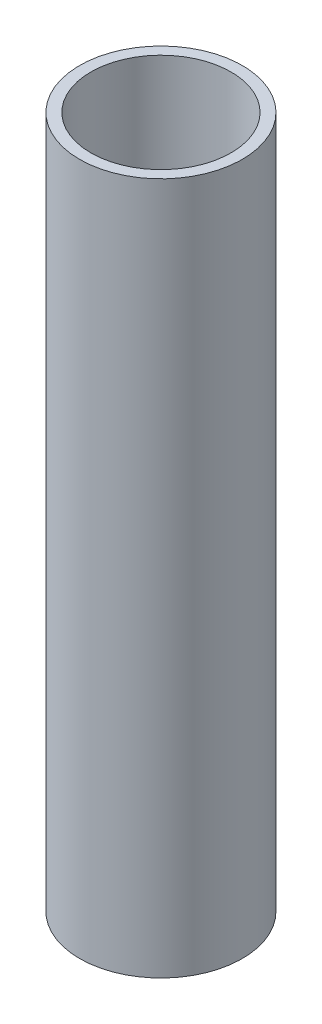
ISO-10303-21;
HEADER;
FILE_DESCRIPTION(('STEP AP214'),'2;1');
FILE_NAME('part.step','',(''),(''),'','','');
FILE_SCHEMA(('AUTOMOTIVE_DESIGN { 1 0 10303 214 1 1 1 1 }'));
ENDSEC;
DATA;
#1=APPLICATION_CONTEXT('core data for automotive mechanical design processes');
#2=APPLICATION_PROTOCOL_DEFINITION('international standard','automotive_design',2000,#1);
#3=PRODUCT_CONTEXT('',#1,'mechanical');
#4=PRODUCT('Part','Part','',(#3));
#5=PRODUCT_RELATED_PRODUCT_CATEGORY('part','',(#4));
#6=PRODUCT_DEFINITION_FORMATION('','',#4);
#7=PRODUCT_DEFINITION_CONTEXT('part definition',#1,'design');
#8=PRODUCT_DEFINITION('design','',#6,#7);
#9=PRODUCT_DEFINITION_SHAPE('','',#8);
#10=(LENGTH_UNIT() NAMED_UNIT(*) SI_UNIT(.MILLI.,.METRE.));
#11=(NAMED_UNIT(*) PLANE_ANGLE_UNIT() SI_UNIT($,.RADIAN.));
#12=(NAMED_UNIT(*) SI_UNIT($,.STERADIAN.) SOLID_ANGLE_UNIT());
#13=UNCERTAINTY_MEASURE_WITH_UNIT(LENGTH_MEASURE(1.E-05),#10,'distance_accuracy_value','');
#14=(GEOMETRIC_REPRESENTATION_CONTEXT(3) GLOBAL_UNCERTAINTY_ASSIGNED_CONTEXT((#13)) GLOBAL_UNIT_ASSIGNED_CONTEXT((#10,
#11,#12)) REPRESENTATION_CONTEXT('',''));
#15=CARTESIAN_POINT('',(0.,0.,0.));
#16=DIRECTION('',(0.,0.,1.));
#17=DIRECTION('',(1.,0.,0.));
#18=AXIS2_PLACEMENT_3D('',#15,#16,#17);
#19=CARTESIAN_POINT('',(0.,256.625,0.));
#20=DIRECTION('',(0.,1.,0.));
#21=DIRECTION('',(0.,0.,1.));
#22=AXIS2_PLACEMENT_3D('',#19,#20,#21);
#23=PLANE('',#22);
#24=CARTESIAN_POINT('',(0.,256.625,0.));
#25=DIRECTION('',(0.,1.,0.));
#26=DIRECTION('',(0.,0.,1.));
#27=AXIS2_PLACEMENT_3D('',#24,#25,#26);
#28=CIRCLE('',#27,30.1625);
#29=CARTESIAN_POINT('',(0.,256.625,30.1625));
#30=VERTEX_POINT('',#29);
#31=EDGE_CURVE('E10',#30,#30,#28,.T.);
#32=ORIENTED_EDGE('',*,*,#31,.T.);
#33=EDGE_LOOP('',(#32));
#34=FACE_BOUND('',#33,.T.);
#35=CARTESIAN_POINT('',(0.,256.625,0.));
#36=DIRECTION('',(0.,1.,0.));
#37=DIRECTION('',(0.,0.,1.));
#38=AXIS2_PLACEMENT_3D('',#35,#36,#37);
#39=CIRCLE('',#38,25.9969);
#40=CARTESIAN_POINT('',(0.,256.625,25.9969));
#41=VERTEX_POINT('',#40);
#42=EDGE_CURVE('E53',#41,#41,#39,.T.);
#43=ORIENTED_EDGE('',*,*,#42,.F.);
#44=EDGE_LOOP('',(#43));
#45=FACE_BOUND('',#44,.T.);
#46=ADVANCED_FACE('F40',(#34,#45),#23,.T.);
#47=CARTESIAN_POINT('',(0.,0.,0.));
#48=DIRECTION('',(0.,1.,0.));
#49=DIRECTION('',(0.,0.,1.));
#50=AXIS2_PLACEMENT_3D('',#47,#48,#49);
#51=PLANE('',#50);
#52=CARTESIAN_POINT('',(0.,0.,0.));
#53=DIRECTION('',(0.,1.,0.));
#54=DIRECTION('',(0.,0.,1.));
#55=AXIS2_PLACEMENT_3D('',#52,#53,#54);
#56=CIRCLE('',#55,30.1625);
#57=CARTESIAN_POINT('',(0.,0.,30.1625));
#58=VERTEX_POINT('',#57);
#59=EDGE_CURVE('E44',#58,#58,#56,.T.);
#60=ORIENTED_EDGE('',*,*,#59,.F.);
#61=EDGE_LOOP('',(#60));
#62=FACE_BOUND('',#61,.T.);
#63=CARTESIAN_POINT('',(0.,0.,0.));
#64=DIRECTION('',(0.,1.,0.));
#65=DIRECTION('',(0.,0.,1.));
#66=AXIS2_PLACEMENT_3D('',#63,#64,#65);
#67=CIRCLE('',#66,25.9969);
#68=CARTESIAN_POINT('',(0.,0.,25.9969));
#69=VERTEX_POINT('',#68);
#70=EDGE_CURVE('E55',#69,#69,#67,.T.);
#71=ORIENTED_EDGE('',*,*,#70,.T.);
#72=EDGE_LOOP('',(#71));
#73=FACE_BOUND('',#72,.T.);
#74=ADVANCED_FACE('F67',(#62,#73),#51,.F.);
#75=CARTESIAN_POINT('',(0.,256.625,0.));
#76=DIRECTION('',(0.,-1.,0.));
#77=DIRECTION('',(0.,0.,-1.));
#78=AXIS2_PLACEMENT_3D('',#75,#76,#77);
#79=CYLINDRICAL_SURFACE('',#78,30.1625);
#80=ORIENTED_EDGE('',*,*,#31,.F.);
#81=EDGE_LOOP('',(#80));
#82=FACE_BOUND('',#81,.T.);
#83=ORIENTED_EDGE('',*,*,#59,.T.);
#84=EDGE_LOOP('',(#83));
#85=FACE_BOUND('',#84,.T.);
#86=ADVANCED_FACE('F42',(#82,#85),#79,.T.);
#87=CARTESIAN_POINT('',(0.,256.625,0.));
#88=DIRECTION('',(0.,-1.,0.));
#89=DIRECTION('',(0.,0.,-1.));
#90=AXIS2_PLACEMENT_3D('',#87,#88,#89);
#91=CYLINDRICAL_SURFACE('',#90,25.9969);
#92=ORIENTED_EDGE('',*,*,#42,.T.);
#93=EDGE_LOOP('',(#92));
#94=FACE_BOUND('',#93,.T.);
#95=ORIENTED_EDGE('',*,*,#70,.F.);
#96=EDGE_LOOP('',(#95));
#97=FACE_BOUND('',#96,.T.);
#98=ADVANCED_FACE('F63',(#94,#97),#91,.F.);
#99=CLOSED_SHELL('',(#46,#74,#86,#98));
#100=MANIFOLD_SOLID_BREP('B2',#99);
#101=ADVANCED_BREP_SHAPE_REPRESENTATION('',(#18,#100),#14);
#102=SHAPE_DEFINITION_REPRESENTATION(#9,#101);
ENDSEC;
END-ISO-10303-21;
